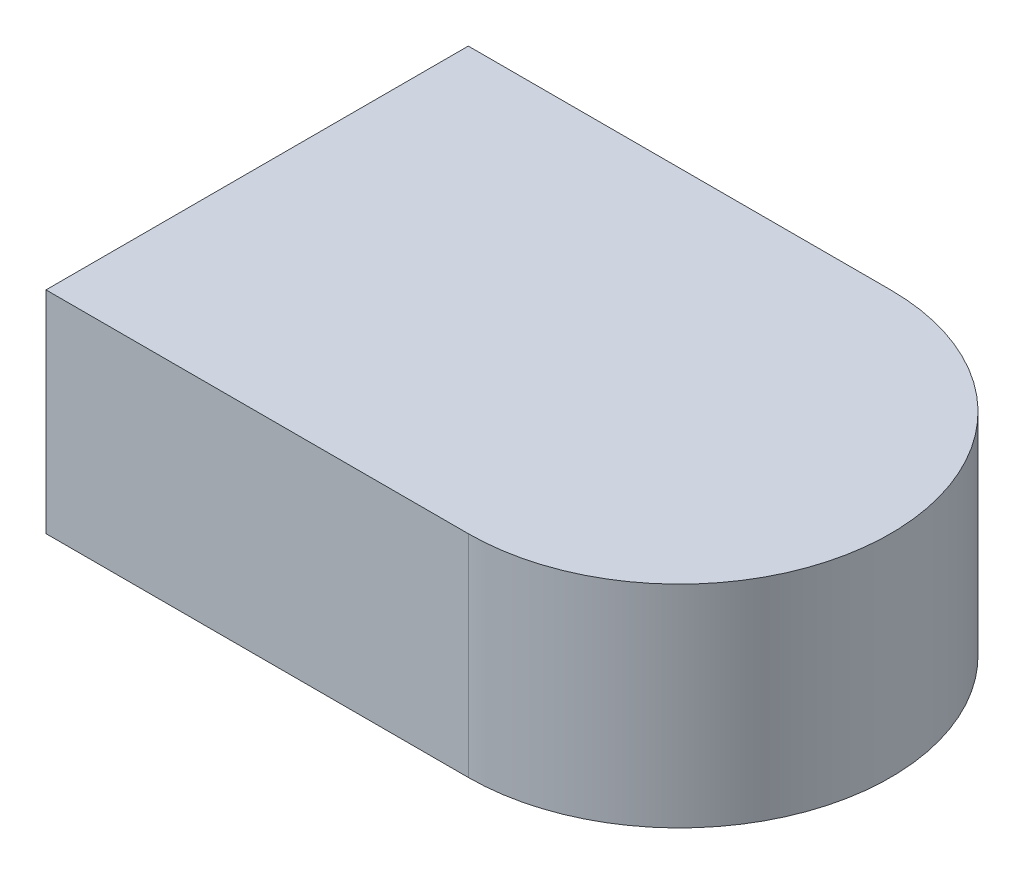
ISO-10303-21;
HEADER;
FILE_DESCRIPTION(('STEP AP214'),'2;1');
FILE_NAME('part.step','',(''),(''),'','','');
FILE_SCHEMA(('AUTOMOTIVE_DESIGN { 1 0 10303 214 1 1 1 1 }'));
ENDSEC;
DATA;
#1=APPLICATION_CONTEXT('core data for automotive mechanical design processes');
#2=APPLICATION_PROTOCOL_DEFINITION('international standard','automotive_design',2000,#1);
#3=PRODUCT_CONTEXT('',#1,'mechanical');
#4=PRODUCT('Part','Part','',(#3));
#5=PRODUCT_RELATED_PRODUCT_CATEGORY('part','',(#4));
#6=PRODUCT_DEFINITION_FORMATION('','',#4);
#7=PRODUCT_DEFINITION_CONTEXT('part definition',#1,'design');
#8=PRODUCT_DEFINITION('design','',#6,#7);
#9=PRODUCT_DEFINITION_SHAPE('','',#8);
#10=(LENGTH_UNIT() NAMED_UNIT(*) SI_UNIT(.MILLI.,.METRE.));
#11=(NAMED_UNIT(*) PLANE_ANGLE_UNIT() SI_UNIT($,.RADIAN.));
#12=(NAMED_UNIT(*) SI_UNIT($,.STERADIAN.) SOLID_ANGLE_UNIT());
#13=UNCERTAINTY_MEASURE_WITH_UNIT(LENGTH_MEASURE(1.E-05),#10,'distance_accuracy_value','');
#14=(GEOMETRIC_REPRESENTATION_CONTEXT(3) GLOBAL_UNCERTAINTY_ASSIGNED_CONTEXT((#13)) GLOBAL_UNIT_ASSIGNED_CONTEXT((#10,
#11,#12)) REPRESENTATION_CONTEXT('',''));
#15=CARTESIAN_POINT('',(0.,0.,0.));
#16=DIRECTION('',(0.,0.,1.));
#17=DIRECTION('',(1.,0.,0.));
#18=AXIS2_PLACEMENT_3D('',#15,#16,#17);
#19=CARTESIAN_POINT('',(0.,0.,0.));
#20=DIRECTION('',(0.,-1.,0.));
#21=DIRECTION('',(-1.,0.,0.));
#22=AXIS2_PLACEMENT_3D('',#19,#20,#21);
#23=PLANE('',#22);
#24=CARTESIAN_POINT('',(-1.05,0.,-0.2));
#25=DIRECTION('',(0.,-1.,0.));
#26=DIRECTION('',(0.,0.,-1.));
#27=AXIS2_PLACEMENT_3D('',#24,#25,#26);
#28=CIRCLE('',#27,0.1);
#29=CARTESIAN_POINT('',(-1.05,0.,-0.3));
#30=VERTEX_POINT('',#29);
#31=CARTESIAN_POINT('',(-1.05,0.,-0.1));
#32=VERTEX_POINT('',#31);
#33=EDGE_CURVE('E11',#30,#32,#28,.T.);
#34=ORIENTED_EDGE('',*,*,#33,.T.);
#35=DIRECTION('',(-1.,0.,0.));
#36=VECTOR('',#35,1.);
#37=CARTESIAN_POINT('',(-1.05,0.,-0.1));
#38=LINE('',#37,#36);
#39=CARTESIAN_POINT('',(-1.25,0.,-0.1));
#40=VERTEX_POINT('',#39);
#41=EDGE_CURVE('E25',#32,#40,#38,.T.);
#42=ORIENTED_EDGE('',*,*,#41,.T.);
#43=DIRECTION('',(0.,0.,-1.));
#44=VECTOR('',#43,1.);
#45=CARTESIAN_POINT('',(-1.25,0.,-0.1));
#46=LINE('',#45,#44);
#47=CARTESIAN_POINT('',(-1.25,0.,-0.3));
#48=VERTEX_POINT('',#47);
#49=EDGE_CURVE('E73',#40,#48,#46,.T.);
#50=ORIENTED_EDGE('',*,*,#49,.T.);
#51=DIRECTION('',(1.,0.,0.));
#52=VECTOR('',#51,1.);
#53=CARTESIAN_POINT('',(-1.25,0.,-0.3));
#54=LINE('',#53,#52);
#55=EDGE_CURVE('E99',#48,#30,#54,.T.);
#56=ORIENTED_EDGE('',*,*,#55,.T.);
#57=EDGE_LOOP('',(#34,#42,#50,#56));
#58=FACE_BOUND('',#57,.T.);
#59=ADVANCED_FACE('F17',(#58),#23,.T.);
#60=CARTESIAN_POINT('',(-1.25,0.,-0.3));
#61=DIRECTION('',(0.,0.,1.));
#62=DIRECTION('',(1.,0.,0.));
#63=AXIS2_PLACEMENT_3D('',#60,#61,#62);
#64=PLANE('',#63);
#65=DIRECTION('',(0.,1.,0.));
#66=VECTOR('',#65,1.);
#67=CARTESIAN_POINT('',(-1.25,0.,-0.3));
#68=LINE('',#67,#66);
#69=CARTESIAN_POINT('',(-1.25,0.1,-0.3));
#70=VERTEX_POINT('',#69);
#71=EDGE_CURVE('E95',#48,#70,#68,.T.);
#72=ORIENTED_EDGE('',*,*,#71,.T.);
#73=DIRECTION('',(1.,0.,0.));
#74=VECTOR('',#73,1.);
#75=CARTESIAN_POINT('',(-1.25,0.1,-0.3));
#76=LINE('',#75,#74);
#77=CARTESIAN_POINT('',(-1.05,0.1,-0.3));
#78=VERTEX_POINT('',#77);
#79=EDGE_CURVE('E68',#70,#78,#76,.T.);
#80=ORIENTED_EDGE('',*,*,#79,.T.);
#81=DIRECTION('',(0.,1.,0.));
#82=VECTOR('',#81,1.);
#83=CARTESIAN_POINT('',(-1.05,0.,-0.3));
#84=LINE('',#83,#82);
#85=EDGE_CURVE('E87',#30,#78,#84,.T.);
#86=ORIENTED_EDGE('',*,*,#85,.F.);
#87=ORIENTED_EDGE('',*,*,#55,.F.);
#88=EDGE_LOOP('',(#72,#80,#86,#87));
#89=FACE_BOUND('',#88,.T.);
#90=ADVANCED_FACE('F113',(#89),#64,.F.);
#91=CARTESIAN_POINT('',(-1.05,0.,-0.2));
#92=DIRECTION('',(0.,-1.,0.));
#93=DIRECTION('',(-1.,0.,0.));
#94=AXIS2_PLACEMENT_3D('',#91,#92,#93);
#95=CYLINDRICAL_SURFACE('',#94,0.1);
#96=ORIENTED_EDGE('',*,*,#85,.T.);
#97=CARTESIAN_POINT('',(-1.05,0.1,-0.2));
#98=DIRECTION('',(0.,-1.,0.));
#99=DIRECTION('',(0.,0.,-1.));
#100=AXIS2_PLACEMENT_3D('',#97,#98,#99);
#101=CIRCLE('',#100,0.1);
#102=CARTESIAN_POINT('',(-1.05,0.1,-0.1));
#103=VERTEX_POINT('',#102);
#104=EDGE_CURVE('E83',#78,#103,#101,.T.);
#105=ORIENTED_EDGE('',*,*,#104,.T.);
#106=DIRECTION('',(0.,1.,0.));
#107=VECTOR('',#106,1.);
#108=CARTESIAN_POINT('',(-1.05,0.,-0.1));
#109=LINE('',#108,#107);
#110=EDGE_CURVE('E60',#32,#103,#109,.T.);
#111=ORIENTED_EDGE('',*,*,#110,.F.);
#112=ORIENTED_EDGE('',*,*,#33,.F.);
#113=EDGE_LOOP('',(#96,#105,#111,#112));
#114=FACE_BOUND('',#113,.T.);
#115=ADVANCED_FACE('F115',(#114),#95,.T.);
#116=CARTESIAN_POINT('',(-1.05,0.,-0.1));
#117=DIRECTION('',(0.,0.,-1.));
#118=DIRECTION('',(-1.,0.,0.));
#119=AXIS2_PLACEMENT_3D('',#116,#117,#118);
#120=PLANE('',#119);
#121=ORIENTED_EDGE('',*,*,#110,.T.);
#122=DIRECTION('',(-1.,0.,0.));
#123=VECTOR('',#122,1.);
#124=CARTESIAN_POINT('',(-1.05,0.1,-0.1));
#125=LINE('',#124,#123);
#126=CARTESIAN_POINT('',(-1.25,0.1,-0.1));
#127=VERTEX_POINT('',#126);
#128=EDGE_CURVE('E53',#103,#127,#125,.T.);
#129=ORIENTED_EDGE('',*,*,#128,.T.);
#130=DIRECTION('',(0.,1.,0.));
#131=VECTOR('',#130,1.);
#132=CARTESIAN_POINT('',(-1.25,0.,-0.1));
#133=LINE('',#132,#131);
#134=EDGE_CURVE('E57',#40,#127,#133,.T.);
#135=ORIENTED_EDGE('',*,*,#134,.F.);
#136=ORIENTED_EDGE('',*,*,#41,.F.);
#137=EDGE_LOOP('',(#121,#129,#135,#136));
#138=FACE_BOUND('',#137,.T.);
#139=ADVANCED_FACE('F55',(#138),#120,.F.);
#140=CARTESIAN_POINT('',(-1.25,0.,-0.1));
#141=DIRECTION('',(1.,0.,0.));
#142=DIRECTION('',(0.,0.,-1.));
#143=AXIS2_PLACEMENT_3D('',#140,#141,#142);
#144=PLANE('',#143);
#145=ORIENTED_EDGE('',*,*,#134,.T.);
#146=DIRECTION('',(0.,0.,-1.));
#147=VECTOR('',#146,1.);
#148=CARTESIAN_POINT('',(-1.25,0.1,-0.1));
#149=LINE('',#148,#147);
#150=EDGE_CURVE('E66',#127,#70,#149,.T.);
#151=ORIENTED_EDGE('',*,*,#150,.T.);
#152=ORIENTED_EDGE('',*,*,#71,.F.);
#153=ORIENTED_EDGE('',*,*,#49,.F.);
#154=EDGE_LOOP('',(#145,#151,#152,#153));
#155=FACE_BOUND('',#154,.T.);
#156=ADVANCED_FACE('F72',(#155),#144,.F.);
#157=CARTESIAN_POINT('',(0.,0.1,0.));
#158=DIRECTION('',(0.,-1.,0.));
#159=DIRECTION('',(-1.,0.,0.));
#160=AXIS2_PLACEMENT_3D('',#157,#158,#159);
#161=PLANE('',#160);
#162=ORIENTED_EDGE('',*,*,#150,.F.);
#163=ORIENTED_EDGE('',*,*,#128,.F.);
#164=ORIENTED_EDGE('',*,*,#104,.F.);
#165=ORIENTED_EDGE('',*,*,#79,.F.);
#166=EDGE_LOOP('',(#162,#163,#164,#165));
#167=FACE_BOUND('',#166,.T.);
#168=ADVANCED_FACE('F67',(#167),#161,.F.);
#169=CLOSED_SHELL('',(#59,#90,#115,#139,#156,#168));
#170=MANIFOLD_SOLID_BREP('B1',#169);
#171=ADVANCED_BREP_SHAPE_REPRESENTATION('',(#18,#170),#14);
#172=SHAPE_DEFINITION_REPRESENTATION(#9,#171);
ENDSEC;
END-ISO-10303-21;
